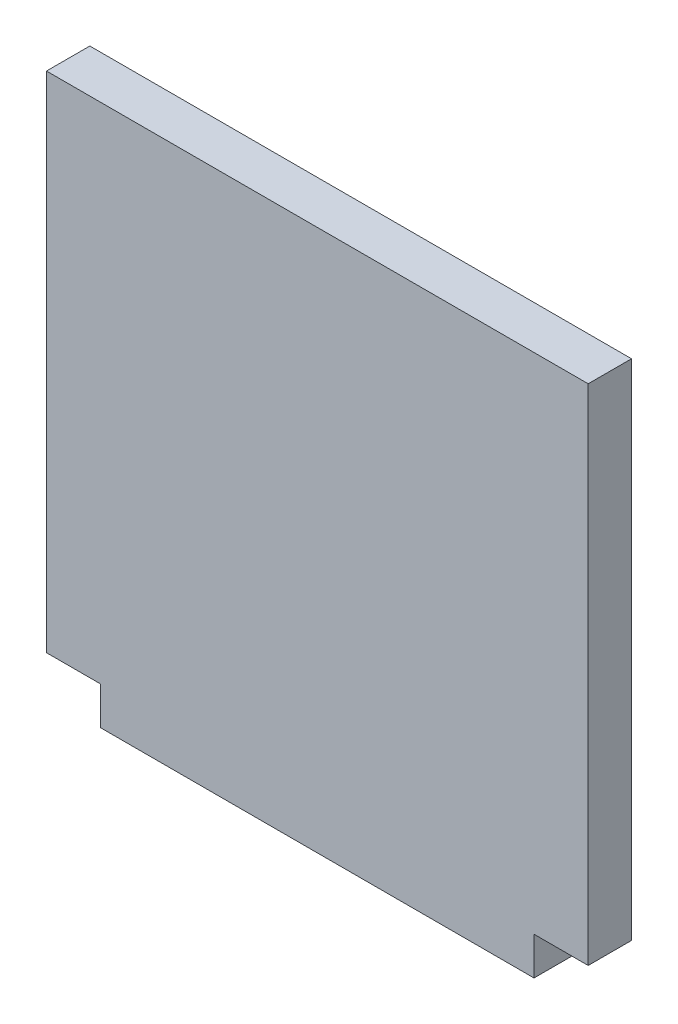
ISO-10303-21;
HEADER;
FILE_DESCRIPTION(('STEP AP214'),'2;1');
FILE_NAME('part.step','',(''),(''),'','','');
FILE_SCHEMA(('AUTOMOTIVE_DESIGN { 1 0 10303 214 1 1 1 1 }'));
ENDSEC;
DATA;
#1=APPLICATION_CONTEXT('core data for automotive mechanical design processes');
#2=APPLICATION_PROTOCOL_DEFINITION('international standard','automotive_design',2000,#1);
#3=PRODUCT_CONTEXT('',#1,'mechanical');
#4=PRODUCT('Part','Part','',(#3));
#5=PRODUCT_RELATED_PRODUCT_CATEGORY('part','',(#4));
#6=PRODUCT_DEFINITION_FORMATION('','',#4);
#7=PRODUCT_DEFINITION_CONTEXT('part definition',#1,'design');
#8=PRODUCT_DEFINITION('design','',#6,#7);
#9=PRODUCT_DEFINITION_SHAPE('','',#8);
#10=(LENGTH_UNIT() NAMED_UNIT(*) SI_UNIT(.MILLI.,.METRE.));
#11=(NAMED_UNIT(*) PLANE_ANGLE_UNIT() SI_UNIT($,.RADIAN.));
#12=(NAMED_UNIT(*) SI_UNIT($,.STERADIAN.) SOLID_ANGLE_UNIT());
#13=UNCERTAINTY_MEASURE_WITH_UNIT(LENGTH_MEASURE(1.E-05),#10,'distance_accuracy_value','');
#14=(GEOMETRIC_REPRESENTATION_CONTEXT(3) GLOBAL_UNCERTAINTY_ASSIGNED_CONTEXT((#13)) GLOBAL_UNIT_ASSIGNED_CONTEXT((#10,
#11,#12)) REPRESENTATION_CONTEXT('',''));
#15=CARTESIAN_POINT('',(0.,0.,0.));
#16=DIRECTION('',(0.,0.,1.));
#17=DIRECTION('',(1.,0.,0.));
#18=AXIS2_PLACEMENT_3D('',#15,#16,#17);
#19=CARTESIAN_POINT('',(-0.399999999999999,0.,0.));
#20=DIRECTION('',(1.,0.,0.));
#21=DIRECTION('',(0.,1.,0.));
#22=AXIS2_PLACEMENT_3D('',#19,#20,#21);
#23=PLANE('',#22);
#24=DIRECTION('',(0.,1.,0.));
#25=VECTOR('',#24,1.);
#26=CARTESIAN_POINT('',(-0.399999999999999,0.,0.08));
#27=LINE('',#26,#25);
#28=CARTESIAN_POINT('',(-0.4,0.866025403784438,0.08));
#29=VERTEX_POINT('',#28);
#30=CARTESIAN_POINT('',(-0.4,0.936025403784438,0.08));
#31=VERTEX_POINT('',#30);
#32=EDGE_CURVE('E132',#29,#31,#27,.T.);
#33=ORIENTED_EDGE('',*,*,#32,.T.);
#34=DIRECTION('',(0.,0.,1.));
#35=VECTOR('',#34,1.);
#36=CARTESIAN_POINT('',(-0.4,0.936025403784438,0.));
#37=LINE('',#36,#35);
#38=CARTESIAN_POINT('',(-0.4,0.936025403784438,0.));
#39=VERTEX_POINT('',#38);
#40=EDGE_CURVE('E11',#39,#31,#37,.T.);
#41=ORIENTED_EDGE('',*,*,#40,.F.);
#42=DIRECTION('',(0.,1.,0.));
#43=VECTOR('',#42,1.);
#44=CARTESIAN_POINT('',(-0.399999999999999,0.,0.));
#45=LINE('',#44,#43);
#46=CARTESIAN_POINT('',(-0.4,0.866025403784438,0.));
#47=VERTEX_POINT('',#46);
#48=EDGE_CURVE('E53',#47,#39,#45,.T.);
#49=ORIENTED_EDGE('',*,*,#48,.F.);
#50=DIRECTION('',(0.,0.,1.));
#51=VECTOR('',#50,1.);
#52=CARTESIAN_POINT('',(-0.4,0.866025403784438,0.));
#53=LINE('',#52,#51);
#54=EDGE_CURVE('E38',#47,#29,#53,.T.);
#55=ORIENTED_EDGE('',*,*,#54,.T.);
#56=EDGE_LOOP('',(#33,#41,#49,#55));
#57=FACE_BOUND('',#56,.T.);
#58=ADVANCED_FACE('F35',(#57),#23,.F.);
#59=CARTESIAN_POINT('',(0.,0.936025403784438,0.));
#60=DIRECTION('',(0.,-1.,0.));
#61=DIRECTION('',(1.,0.,0.));
#62=AXIS2_PLACEMENT_3D('',#59,#60,#61);
#63=PLANE('',#62);
#64=DIRECTION('',(1.,0.,0.));
#65=VECTOR('',#64,1.);
#66=CARTESIAN_POINT('',(0.,0.936025403784438,0.08));
#67=LINE('',#66,#65);
#68=CARTESIAN_POINT('',(-0.5,0.936025403784439,0.08));
#69=VERTEX_POINT('',#68);
#70=EDGE_CURVE('E148',#69,#31,#67,.T.);
#71=ORIENTED_EDGE('',*,*,#70,.F.);
#72=DIRECTION('',(0.,0.,1.));
#73=VECTOR('',#72,1.);
#74=CARTESIAN_POINT('',(-0.5,0.936025403784439,0.));
#75=LINE('',#74,#73);
#76=CARTESIAN_POINT('',(-0.5,0.936025403784439,0.));
#77=VERTEX_POINT('',#76);
#78=EDGE_CURVE('E44',#77,#69,#75,.T.);
#79=ORIENTED_EDGE('',*,*,#78,.F.);
#80=DIRECTION('',(1.,0.,0.));
#81=VECTOR('',#80,1.);
#82=CARTESIAN_POINT('',(0.,0.936025403784438,0.));
#83=LINE('',#82,#81);
#84=EDGE_CURVE('E112',#77,#39,#83,.T.);
#85=ORIENTED_EDGE('',*,*,#84,.T.);
#86=ORIENTED_EDGE('',*,*,#40,.T.);
#87=EDGE_LOOP('',(#71,#79,#85,#86));
#88=FACE_BOUND('',#87,.T.);
#89=ADVANCED_FACE('F165',(#88),#63,.T.);
#90=CARTESIAN_POINT('',(-0.5,0.,0.));
#91=DIRECTION('',(1.,0.,0.));
#92=DIRECTION('',(0.,1.,0.));
#93=AXIS2_PLACEMENT_3D('',#90,#91,#92);
#94=PLANE('',#93);
#95=DIRECTION('',(0.,1.,0.));
#96=VECTOR('',#95,1.);
#97=CARTESIAN_POINT('',(-0.5,0.,0.08));
#98=LINE('',#97,#96);
#99=CARTESIAN_POINT('',(-0.5,1.86602540378444,0.08));
#100=VERTEX_POINT('',#99);
#101=EDGE_CURVE('E117',#69,#100,#98,.T.);
#102=ORIENTED_EDGE('',*,*,#101,.T.);
#103=DIRECTION('',(0.,0.,1.));
#104=VECTOR('',#103,1.);
#105=CARTESIAN_POINT('',(-0.5,1.86602540378444,0.));
#106=LINE('',#105,#104);
#107=CARTESIAN_POINT('',(-0.5,1.86602540378444,0.));
#108=VERTEX_POINT('',#107);
#109=EDGE_CURVE('E115',#108,#100,#106,.T.);
#110=ORIENTED_EDGE('',*,*,#109,.F.);
#111=DIRECTION('',(0.,1.,0.));
#112=VECTOR('',#111,1.);
#113=CARTESIAN_POINT('',(-0.5,0.,0.));
#114=LINE('',#113,#112);
#115=EDGE_CURVE('E105',#77,#108,#114,.T.);
#116=ORIENTED_EDGE('',*,*,#115,.F.);
#117=ORIENTED_EDGE('',*,*,#78,.T.);
#118=EDGE_LOOP('',(#102,#110,#116,#117));
#119=FACE_BOUND('',#118,.T.);
#120=ADVANCED_FACE('F116',(#119),#94,.F.);
#121=CARTESIAN_POINT('',(0.,1.86602540378444,0.));
#122=DIRECTION('',(0.,-1.,0.));
#123=DIRECTION('',(1.,0.,0.));
#124=AXIS2_PLACEMENT_3D('',#121,#122,#123);
#125=PLANE('',#124);
#126=DIRECTION('',(1.,0.,0.));
#127=VECTOR('',#126,1.);
#128=CARTESIAN_POINT('',(0.,1.86602540378444,0.08));
#129=LINE('',#128,#127);
#130=CARTESIAN_POINT('',(0.499999999999999,1.86602540378444,0.08));
#131=VERTEX_POINT('',#130);
#132=EDGE_CURVE('E145',#100,#131,#129,.T.);
#133=ORIENTED_EDGE('',*,*,#132,.T.);
#134=DIRECTION('',(0.,0.,1.));
#135=VECTOR('',#134,1.);
#136=CARTESIAN_POINT('',(0.499999999999999,1.86602540378444,0.));
#137=LINE('',#136,#135);
#138=CARTESIAN_POINT('',(0.499999999999999,1.86602540378444,0.));
#139=VERTEX_POINT('',#138);
#140=EDGE_CURVE('E121',#139,#131,#137,.T.);
#141=ORIENTED_EDGE('',*,*,#140,.F.);
#142=DIRECTION('',(1.,0.,0.));
#143=VECTOR('',#142,1.);
#144=CARTESIAN_POINT('',(0.,1.86602540378444,0.));
#145=LINE('',#144,#143);
#146=EDGE_CURVE('E110',#108,#139,#145,.T.);
#147=ORIENTED_EDGE('',*,*,#146,.F.);
#148=ORIENTED_EDGE('',*,*,#109,.T.);
#149=EDGE_LOOP('',(#133,#141,#147,#148));
#150=FACE_BOUND('',#149,.T.);
#151=ADVANCED_FACE('F123',(#150),#125,.F.);
#152=CARTESIAN_POINT('',(0.5,0.,0.));
#153=DIRECTION('',(1.,0.,0.));
#154=DIRECTION('',(0.,1.,0.));
#155=AXIS2_PLACEMENT_3D('',#152,#153,#154);
#156=PLANE('',#155);
#157=DIRECTION('',(0.,1.,0.));
#158=VECTOR('',#157,1.);
#159=CARTESIAN_POINT('',(0.5,0.,0.08));
#160=LINE('',#159,#158);
#161=CARTESIAN_POINT('',(0.5,0.936025403784439,0.08));
#162=VERTEX_POINT('',#161);
#163=EDGE_CURVE('E142',#162,#131,#160,.T.);
#164=ORIENTED_EDGE('',*,*,#163,.F.);
#165=DIRECTION('',(0.,0.,1.));
#166=VECTOR('',#165,1.);
#167=CARTESIAN_POINT('',(0.5,0.936025403784439,0.));
#168=LINE('',#167,#166);
#169=CARTESIAN_POINT('',(0.5,0.936025403784439,0.));
#170=VERTEX_POINT('',#169);
#171=EDGE_CURVE('E153',#170,#162,#168,.T.);
#172=ORIENTED_EDGE('',*,*,#171,.F.);
#173=DIRECTION('',(0.,1.,0.));
#174=VECTOR('',#173,1.);
#175=CARTESIAN_POINT('',(0.5,0.,0.));
#176=LINE('',#175,#174);
#177=EDGE_CURVE('E125',#170,#139,#176,.T.);
#178=ORIENTED_EDGE('',*,*,#177,.T.);
#179=ORIENTED_EDGE('',*,*,#140,.T.);
#180=EDGE_LOOP('',(#164,#172,#178,#179));
#181=FACE_BOUND('',#180,.T.);
#182=ADVANCED_FACE('F178',(#181),#156,.T.);
#183=CARTESIAN_POINT('',(0.,0.936025403784438,0.));
#184=DIRECTION('',(0.,1.,0.));
#185=DIRECTION('',(-1.,0.,0.));
#186=AXIS2_PLACEMENT_3D('',#183,#184,#185);
#187=PLANE('',#186);
#188=DIRECTION('',(-1.,0.,0.));
#189=VECTOR('',#188,1.);
#190=CARTESIAN_POINT('',(0.,0.936025403784438,0.08));
#191=LINE('',#190,#189);
#192=CARTESIAN_POINT('',(0.4,0.936025403784439,0.08));
#193=VERTEX_POINT('',#192);
#194=EDGE_CURVE('E139',#162,#193,#191,.T.);
#195=ORIENTED_EDGE('',*,*,#194,.T.);
#196=DIRECTION('',(0.,0.,1.));
#197=VECTOR('',#196,1.);
#198=CARTESIAN_POINT('',(0.4,0.936025403784439,0.));
#199=LINE('',#198,#197);
#200=CARTESIAN_POINT('',(0.4,0.936025403784439,0.));
#201=VERTEX_POINT('',#200);
#202=EDGE_CURVE('E155',#201,#193,#199,.T.);
#203=ORIENTED_EDGE('',*,*,#202,.F.);
#204=DIRECTION('',(-1.,0.,0.));
#205=VECTOR('',#204,1.);
#206=CARTESIAN_POINT('',(0.,0.936025403784438,0.));
#207=LINE('',#206,#205);
#208=EDGE_CURVE('E127',#170,#201,#207,.T.);
#209=ORIENTED_EDGE('',*,*,#208,.F.);
#210=ORIENTED_EDGE('',*,*,#171,.T.);
#211=EDGE_LOOP('',(#195,#203,#209,#210));
#212=FACE_BOUND('',#211,.T.);
#213=ADVANCED_FACE('F181',(#212),#187,.F.);
#214=CARTESIAN_POINT('',(0.399999999999999,0.,0.));
#215=DIRECTION('',(1.,0.,0.));
#216=DIRECTION('',(0.,1.,0.));
#217=AXIS2_PLACEMENT_3D('',#214,#215,#216);
#218=PLANE('',#217);
#219=DIRECTION('',(0.,1.,0.));
#220=VECTOR('',#219,1.);
#221=CARTESIAN_POINT('',(0.399999999999999,0.,0.08));
#222=LINE('',#221,#220);
#223=CARTESIAN_POINT('',(0.4,0.866025403784438,0.08));
#224=VERTEX_POINT('',#223);
#225=EDGE_CURVE('E136',#224,#193,#222,.T.);
#226=ORIENTED_EDGE('',*,*,#225,.F.);
#227=DIRECTION('',(0.,0.,1.));
#228=VECTOR('',#227,1.);
#229=CARTESIAN_POINT('',(0.4,0.866025403784438,0.));
#230=LINE('',#229,#228);
#231=CARTESIAN_POINT('',(0.4,0.866025403784438,0.));
#232=VERTEX_POINT('',#231);
#233=EDGE_CURVE('E156',#232,#224,#230,.T.);
#234=ORIENTED_EDGE('',*,*,#233,.F.);
#235=DIRECTION('',(0.,1.,0.));
#236=VECTOR('',#235,1.);
#237=CARTESIAN_POINT('',(0.399999999999999,0.,0.));
#238=LINE('',#237,#236);
#239=EDGE_CURVE('E265',#232,#201,#238,.T.);
#240=ORIENTED_EDGE('',*,*,#239,.T.);
#241=ORIENTED_EDGE('',*,*,#202,.T.);
#242=EDGE_LOOP('',(#226,#234,#240,#241));
#243=FACE_BOUND('',#242,.T.);
#244=ADVANCED_FACE('F185',(#243),#218,.T.);
#245=CARTESIAN_POINT('',(0.,0.866025403784438,0.));
#246=DIRECTION('',(0.,1.,0.));
#247=DIRECTION('',(0.,0.,1.));
#248=AXIS2_PLACEMENT_3D('',#245,#246,#247);
#249=PLANE('',#248);
#250=DIRECTION('',(-1.,0.,0.));
#251=VECTOR('',#250,1.);
#252=CARTESIAN_POINT('',(0.,0.866025403784438,0.08));
#253=LINE('',#252,#251);
#254=EDGE_CURVE('E134',#224,#29,#253,.T.);
#255=ORIENTED_EDGE('',*,*,#254,.T.);
#256=ORIENTED_EDGE('',*,*,#54,.F.);
#257=DIRECTION('',(-1.,0.,0.));
#258=VECTOR('',#257,1.);
#259=CARTESIAN_POINT('',(0.,0.866025403784438,0.));
#260=LINE('',#259,#258);
#261=EDGE_CURVE('E91',#232,#47,#260,.T.);
#262=ORIENTED_EDGE('',*,*,#261,.F.);
#263=ORIENTED_EDGE('',*,*,#233,.T.);
#264=EDGE_LOOP('',(#255,#256,#262,#263));
#265=FACE_BOUND('',#264,.T.);
#266=ADVANCED_FACE('F188',(#265),#249,.F.);
#267=CARTESIAN_POINT('',(0.,0.,0.));
#268=DIRECTION('',(0.,0.,1.));
#269=DIRECTION('',(1.,0.,0.));
#270=AXIS2_PLACEMENT_3D('',#267,#268,#269);
#271=PLANE('',#270);
#272=ORIENTED_EDGE('',*,*,#48,.T.);
#273=ORIENTED_EDGE('',*,*,#84,.F.);
#274=ORIENTED_EDGE('',*,*,#115,.T.);
#275=ORIENTED_EDGE('',*,*,#146,.T.);
#276=ORIENTED_EDGE('',*,*,#177,.F.);
#277=ORIENTED_EDGE('',*,*,#208,.T.);
#278=ORIENTED_EDGE('',*,*,#239,.F.);
#279=ORIENTED_EDGE('',*,*,#261,.T.);
#280=EDGE_LOOP('',(#272,#273,#274,#275,#276,#277,#278,#279));
#281=FACE_BOUND('',#280,.T.);
#282=ADVANCED_FACE('F107',(#281),#271,.F.);
#283=CARTESIAN_POINT('',(0.,0.,0.08));
#284=DIRECTION('',(0.,0.,1.));
#285=DIRECTION('',(1.,0.,0.));
#286=AXIS2_PLACEMENT_3D('',#283,#284,#285);
#287=PLANE('',#286);
#288=ORIENTED_EDGE('',*,*,#32,.F.);
#289=ORIENTED_EDGE('',*,*,#254,.F.);
#290=ORIENTED_EDGE('',*,*,#225,.T.);
#291=ORIENTED_EDGE('',*,*,#194,.F.);
#292=ORIENTED_EDGE('',*,*,#163,.T.);
#293=ORIENTED_EDGE('',*,*,#132,.F.);
#294=ORIENTED_EDGE('',*,*,#101,.F.);
#295=ORIENTED_EDGE('',*,*,#70,.T.);
#296=EDGE_LOOP('',(#288,#289,#290,#291,#292,#293,#294,#295));
#297=FACE_BOUND('',#296,.T.);
#298=ADVANCED_FACE('F163',(#297),#287,.T.);
#299=CLOSED_SHELL('',(#58,#89,#120,#151,#182,#213,#244,#266,#282,#298));
#300=MANIFOLD_SOLID_BREP('B2',#299);
#301=ADVANCED_BREP_SHAPE_REPRESENTATION('',(#18,#300),#14);
#302=SHAPE_DEFINITION_REPRESENTATION(#9,#301);
ENDSEC;
END-ISO-10303-21;
